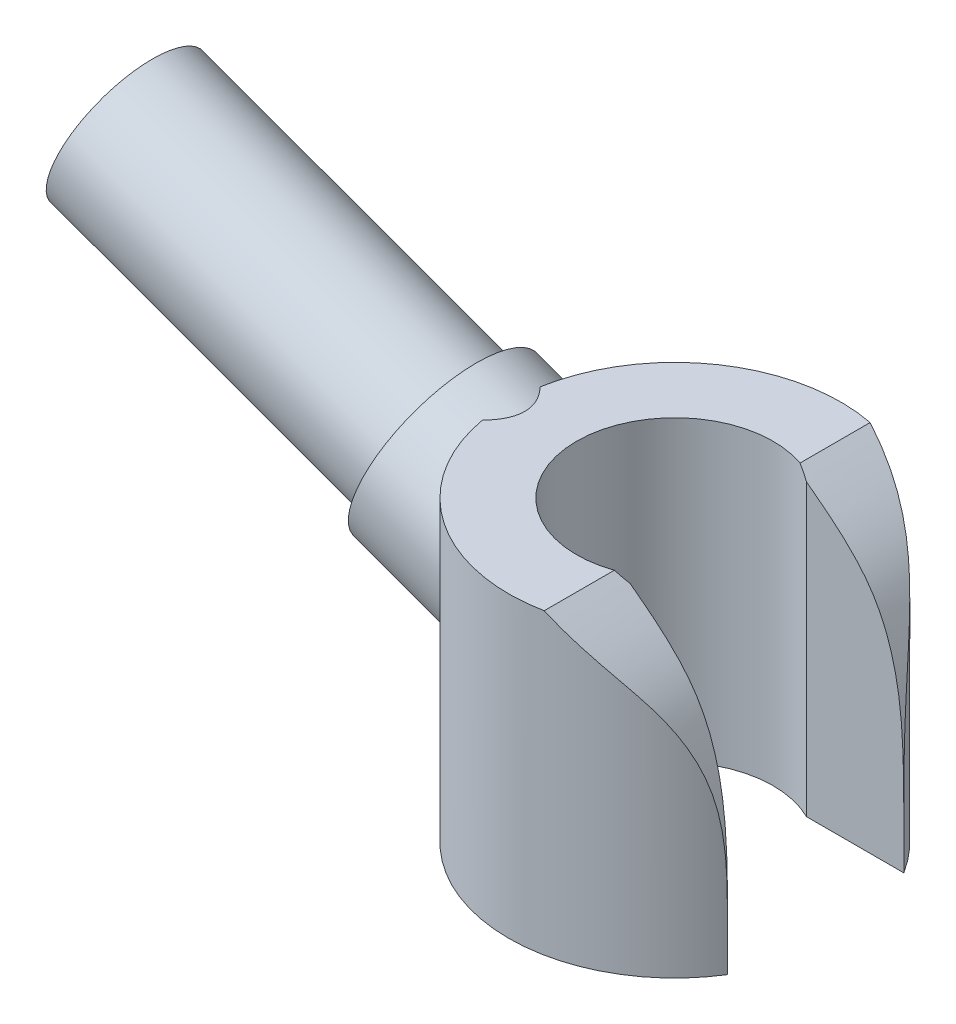
ISO-10303-21;
HEADER;
FILE_DESCRIPTION(('STEP AP214'),'2;1');
FILE_NAME('part.step','',(''),(''),'','','');
FILE_SCHEMA(('AUTOMOTIVE_DESIGN { 1 0 10303 214 1 1 1 1 }'));
ENDSEC;
DATA;
#1=APPLICATION_CONTEXT('core data for automotive mechanical design processes');
#2=APPLICATION_PROTOCOL_DEFINITION('international standard','automotive_design',2000,#1);
#3=PRODUCT_CONTEXT('',#1,'mechanical');
#4=PRODUCT('Part','Part','',(#3));
#5=PRODUCT_RELATED_PRODUCT_CATEGORY('part','',(#4));
#6=PRODUCT_DEFINITION_FORMATION('','',#4);
#7=PRODUCT_DEFINITION_CONTEXT('part definition',#1,'design');
#8=PRODUCT_DEFINITION('design','',#6,#7);
#9=PRODUCT_DEFINITION_SHAPE('','',#8);
#10=(LENGTH_UNIT() NAMED_UNIT(*) SI_UNIT(.MILLI.,.METRE.));
#11=(NAMED_UNIT(*) PLANE_ANGLE_UNIT() SI_UNIT($,.RADIAN.));
#12=(NAMED_UNIT(*) SI_UNIT($,.STERADIAN.) SOLID_ANGLE_UNIT());
#13=UNCERTAINTY_MEASURE_WITH_UNIT(LENGTH_MEASURE(1.E-05),#10,'distance_accuracy_value','');
#14=(GEOMETRIC_REPRESENTATION_CONTEXT(3) GLOBAL_UNCERTAINTY_ASSIGNED_CONTEXT((#13)) GLOBAL_UNIT_ASSIGNED_CONTEXT((#10,
#11,#12)) REPRESENTATION_CONTEXT('',''));
#15=CARTESIAN_POINT('',(0.,0.,0.));
#16=DIRECTION('',(0.,0.,1.));
#17=DIRECTION('',(1.,0.,0.));
#18=AXIS2_PLACEMENT_3D('',#15,#16,#17);
#19=CARTESIAN_POINT('',(-3.38969262078591,3.39202014332566,0.));
#20=DIRECTION('',(0.939692620785913,-0.342020143325657,0.));
#21=DIRECTION('',(0.342020143325657,0.939692620785913,0.));
#22=AXIS2_PLACEMENT_3D('',#19,#20,#21);
#23=PLANE('',#22);
#24=CARTESIAN_POINT('',(-3.38969262078591,3.39202014332566,0.));
#25=DIRECTION('',(0.939692620785913,-0.342020143325657,0.));
#26=DIRECTION('',(0.342020143325657,0.939692620785913,0.));
#27=AXIS2_PLACEMENT_3D('',#24,#25,#26);
#28=CIRCLE('',#27,1.35);
#29=CARTESIAN_POINT('',(-2.92796542729628,4.66060518138664,0.));
#30=VERTEX_POINT('',#29);
#31=EDGE_CURVE('E99',#30,#30,#28,.T.);
#32=ORIENTED_EDGE('',*,*,#31,.F.);
#33=EDGE_LOOP('',(#32));
#34=FACE_BOUND('',#33,.T.);
#35=CARTESIAN_POINT('',(-3.38969262078592,3.39202014332566,0.));
#36=DIRECTION('',(0.939692620785913,-0.342020143325657,0.));
#37=DIRECTION('',(0.342020143325657,0.939692620785913,0.));
#38=AXIS2_PLACEMENT_3D('',#35,#36,#37);
#39=CIRCLE('',#38,1.12);
#40=CARTESIAN_POINT('',(-3.00663006026118,4.44447587860588,0.));
#41=VERTEX_POINT('',#40);
#42=EDGE_CURVE('E11',#41,#41,#39,.F.);
#43=ORIENTED_EDGE('',*,*,#42,.F.);
#44=EDGE_LOOP('',(#43));
#45=FACE_BOUND('',#44,.T.);
#46=ADVANCED_FACE('F31',(#34,#45),#23,.F.);
#47=CARTESIAN_POINT('',(0.,4.4,0.));
#48=DIRECTION('',(0.,-1.,0.));
#49=DIRECTION('',(0.,0.,-1.));
#50=AXIS2_PLACEMENT_3D('',#47,#48,#49);
#51=CYLINDRICAL_SURFACE('',#50,2.45);
#52=CARTESIAN_POINT('',(0.,4.4,0.));
#53=DIRECTION('',(0.,1.,0.));
#54=DIRECTION('',(0.,0.,1.));
#55=AXIS2_PLACEMENT_3D('',#52,#53,#54);
#56=CIRCLE('',#55,2.45);
#57=CARTESIAN_POINT('',(-2.41282575040051,4.4,0.425172786293083));
#58=VERTEX_POINT('',#57);
#59=CARTESIAN_POINT('',(0.476655965729519,4.4,2.4031851968449));
#60=VERTEX_POINT('',#59);
#61=EDGE_CURVE('E96',#58,#60,#56,.T.);
#62=ORIENTED_EDGE('',*,*,#61,.F.);
#63=CARTESIAN_POINT('',(-2.41282575040051,4.4,0.425172786293081));
#64=CARTESIAN_POINT('',(-2.39988591058971,4.36931666462862,0.498618424196825));
#65=CARTESIAN_POINT('',(-2.38418497808994,4.33165567251845,0.568104445327409));
#66=CARTESIAN_POINT('',(-2.34936970274064,4.24545114185926,0.698173793075831));
#67=CARTESIAN_POINT('',(-2.33028634803408,4.19700545458846,0.75882952875616));
#68=CARTESIAN_POINT('',(-2.28612948077436,4.08004201982022,0.883999075099919));
#69=CARTESIAN_POINT('',(-2.26066388099269,4.00945431205265,0.946405969106936));
#70=CARTESIAN_POINT('',(-2.21023213902347,3.85841196111105,1.05885930115519));
#71=CARTESIAN_POINT('',(-2.18526900654357,3.77791126742107,1.10884452592137));
#72=CARTESIAN_POINT('',(-2.138600774343,3.60825552829581,1.19639957112753));
#73=CARTESIAN_POINT('',(-2.11693758719402,3.5190095846158,1.233815958412));
#74=CARTESIAN_POINT('',(-2.08060780242609,3.33454198678018,1.29415014145334));
#75=CARTESIAN_POINT('',(-2.06591879859152,3.23934059703153,1.31711444641755));
#76=CARTESIAN_POINT('',(-2.04962942450803,3.07238775159859,1.34226344597869));
#77=CARTESIAN_POINT('',(-2.04552318660296,3.00148949548302,1.34845409139535));
#78=CARTESIAN_POINT('',(-2.04382468127984,2.85942558252211,1.35103363726961));
#79=CARTESIAN_POINT('',(-2.04622570357059,2.78826027664969,1.34743263486856));
#80=CARTESIAN_POINT('',(-2.05791114257964,2.64742524963446,1.32951726101475));
#81=CARTESIAN_POINT('',(-2.06723343099445,2.57776593543142,1.31514394162494));
#82=CARTESIAN_POINT('',(-2.09198490658899,2.4427889575932,1.27539708611769));
#83=CARTESIAN_POINT('',(-2.10741533266924,2.37747217788597,1.25002131829758));
#84=CARTESIAN_POINT('',(-2.14109851324548,2.25818667462546,1.19131841053264));
#85=CARTESIAN_POINT('',(-2.1590268734982,2.20372815891181,1.15878945211295));
#86=CARTESIAN_POINT('',(-2.19666552665961,2.10116416618872,1.08574696210322));
#87=CARTESIAN_POINT('',(-2.21637627441592,2.05306031857836,1.04523138927833));
#88=CARTESIAN_POINT('',(-2.25717968917954,1.96068729798075,0.954095415711875));
#89=CARTESIAN_POINT('',(-2.27827279989645,1.9169200159042,0.902967147672534));
#90=CARTESIAN_POINT('',(-2.31853593569861,1.83778923823531,0.793897446158502));
#91=CARTESIAN_POINT('',(-2.33770531486261,1.80242855986465,0.735953738389505));
#92=CARTESIAN_POINT('',(-2.37385941456216,1.73807212269698,0.609847409700528));
#93=CARTESIAN_POINT('',(-2.39055960120973,1.7097822295735,0.541240826597591));
#94=CARTESIAN_POINT('',(-2.41829160806683,1.6637999166439,0.399477009497182));
#95=CARTESIAN_POINT('',(-2.42932349039733,1.64610738069723,0.326319825381214));
#96=CARTESIAN_POINT('',(-2.44469405178577,1.62164591289669,0.177617686593814));
#97=CARTESIAN_POINT('',(-2.4490423097322,1.61486134723069,0.10207630779535));
#98=CARTESIAN_POINT('',(-2.4506730629951,1.61230480441462,-0.0492628013254218));
#99=CARTESIAN_POINT('',(-2.44795631220014,1.61653165226557,-0.125060503434175));
#100=CARTESIAN_POINT('',(-2.43583087093539,1.63571906199429,-0.273216736074215));
#101=CARTESIAN_POINT('',(-2.42655327922109,1.65046939394841,-0.345613477724229));
#102=CARTESIAN_POINT('',(-2.40227025242306,1.69021252656254,-0.486530320479415));
#103=CARTESIAN_POINT('',(-2.38726413171334,1.71520655327803,-0.555049956420874));
#104=CARTESIAN_POINT('',(-2.35259878975083,1.77552065605211,-0.687407498496295));
#105=CARTESIAN_POINT('',(-2.33287379678801,1.81098852200446,-0.751160798989491));
#106=CARTESIAN_POINT('',(-2.29075258856597,1.89168813712505,-0.871207547695333));
#107=CARTESIAN_POINT('',(-2.26835543432077,1.93692332303588,-0.927498358865413));
#108=CARTESIAN_POINT('',(-2.22292232291698,2.03724000149835,-1.0316914270965));
#109=CARTESIAN_POINT('',(-2.19988191964633,2.09243363220076,-1.07948436349298));
#110=CARTESIAN_POINT('',(-2.15620723345248,2.21137803473955,-1.1642819527913));
#111=CARTESIAN_POINT('',(-2.13557063656963,2.27512044797391,-1.20129703306693));
#112=CARTESIAN_POINT('',(-2.10074253405258,2.40482854969099,-1.26115205103595));
#113=CARTESIAN_POINT('',(-2.08620019520938,2.47032376887494,-1.28480488903098));
#114=CARTESIAN_POINT('',(-2.06330123879884,2.60526323617005,-1.32127220892876));
#115=CARTESIAN_POINT('',(-2.0549415879834,2.67470552980134,-1.33409200599948));
#116=CARTESIAN_POINT('',(-2.04539936623501,2.81002975162177,-1.34866873134773));
#117=CARTESIAN_POINT('',(-2.04373901619049,2.87580328886916,-1.35116246482938));
#118=CARTESIAN_POINT('',(-2.0459238966236,3.00704331002154,-1.34784795639077));
#119=CARTESIAN_POINT('',(-2.04977347746682,3.07250951031103,-1.34203315447312));
#120=CARTESIAN_POINT('',(-2.0645556958928,3.22712905529824,-1.3192295184921));
#121=CARTESIAN_POINT('',(-2.07766563385608,3.31556009460895,-1.29876654449614));
#122=CARTESIAN_POINT('',(-2.11011344297298,3.48739283810433,-1.2453455534766));
#123=CARTESIAN_POINT('',(-2.12946328983412,3.57078450225028,-1.21236348793717));
#124=CARTESIAN_POINT('',(-2.1720790372472,3.73248748341156,-1.1342797270285));
#125=CARTESIAN_POINT('',(-2.19540749880843,3.81068446439786,-1.08897618798886));
#126=CARTESIAN_POINT('',(-2.24318848715001,3.95878347337886,-0.986804550677004));
#127=CARTESIAN_POINT('',(-2.26764058934425,4.02868859940503,-0.929940793261109));
#128=CARTESIAN_POINT('',(-2.31094350414628,4.14650627088995,-0.81553972022275));
#129=CARTESIAN_POINT('',(-2.3300267595758,4.19612755630985,-0.759854319837121));
#130=CARTESIAN_POINT('',(-2.36554076209757,4.28593096480822,-0.640733386674065));
#131=CARTESIAN_POINT('',(-2.38198173731986,4.32614977364748,-0.577329494468309));
#132=CARTESIAN_POINT('',(-2.40216389305746,4.37466946879719,-0.482628414114282));
#133=CARTESIAN_POINT('',(-2.40771816963635,4.38790214337011,-0.454181248698265));
#134=CARTESIAN_POINT('',(-2.41282575040052,4.40000000000002,-0.425172786293095));
#135=B_SPLINE_CURVE_WITH_KNOTS('',3,(#63,#64,#65,#66,#67,#68,#69,#70,#71,#72,#73,#74,#75,#76,
#77,#78,#79,#80,#81,#82,#83,#84,#85,#86,#87,#88,#89,#90,#91,#92,#93,#94,#95,#96,#97,#98,#99,
#100,#101,#102,#103,#104,#105,#106,#107,#108,#109,#110,#111,#112,#113,#114,#115,#116,#117,#118,
#119,#120,#121,#122,#123,#124,#125,#126,#127,#128,#129,#130,#131,#132,#133,#134),.UNSPECIFIED.,
.F.,.F.,(4,2,2,2,2,2,2,2,2,2,2,2,2,2,2,2,2,2,2,2,2,2,2,2,2,2,2,2,2,2,2,2,2,2,2,4),(0.,
0.240745959479237,0.479390699188284,0.770745393089824,1.06350859748807,1.35972579270513,
1.65498477028629,1.86801439999348,2.08082443700628,2.29480758767701,2.50883416234977,
2.70574454778162,2.90270532536687,3.11341147744042,3.32418814215309,3.55130354498492,
3.7784164587253,4.00520357252416,4.23196648745788,4.45432177345678,4.67670368066733,
4.90238702655036,5.12814991146523,5.35663474540472,5.58489778440962,5.79713123825066,
6.00926050043127,6.20596125466506,6.4028173996647,6.67646816421332,6.95064727982838,
7.22962080211964,7.50848976283755,7.73865718508112,7.9679109861141,8.06341151356881),.UNSPECIFIED.);
#136=CARTESIAN_POINT('',(-2.41282575040051,4.4,-0.425172786293083));
#137=VERTEX_POINT('',#136);
#138=EDGE_CURVE('E92',#58,#137,#135,.T.);
#139=ORIENTED_EDGE('',*,*,#138,.T.);
#140=CARTESIAN_POINT('',(0.476655965729519,4.4,-2.4031851968449));
#141=VERTEX_POINT('',#140);
#142=EDGE_CURVE('E94',#141,#137,#56,.T.);
#143=ORIENTED_EDGE('',*,*,#142,.F.);
#144=CARTESIAN_POINT('',(0.47665596572952,4.4,-2.4031851968449));
#145=CARTESIAN_POINT('',(0.53150353945028,4.3595446771422,-2.39232522079032));
#146=CARTESIAN_POINT('',(0.586095385820755,4.3192663629422,-2.37952807735011));
#147=CARTESIAN_POINT('',(0.694254976975693,4.23861947370203,-2.35023966806376));
#148=CARTESIAN_POINT('',(0.747822206110757,4.1982508640704,-2.33374659266907));
#149=CARTESIAN_POINT('',(0.853376853149585,4.11700887504917,-2.29725346948604));
#150=CARTESIAN_POINT('',(0.905363914473166,4.07613538461223,-2.27725263693141));
#151=CARTESIAN_POINT('',(1.00765188089936,3.99312981911943,-2.2338858811418));
#152=CARTESIAN_POINT('',(1.05793569706213,3.9509902264753,-2.21049398863174));
#153=CARTESIAN_POINT('',(1.15584310009094,3.86533390120601,-2.16091121304236));
#154=CARTESIAN_POINT('',(1.20346773972593,3.82181772441446,-2.13472144977744));
#155=CARTESIAN_POINT('',(1.29557074091572,3.73290418563762,-2.08011029940707));
#156=CARTESIAN_POINT('',(1.34004982536836,3.68750725970598,-2.05168942823394));
#157=CARTESIAN_POINT('',(1.4060444658371,3.61536984242393,-2.00657467526936));
#158=CARTESIAN_POINT('',(1.42884602046909,3.58947954097563,-1.99039176140458));
#159=CARTESIAN_POINT('',(1.47325824708642,3.53686461206565,-1.9577458782058));
#160=CARTESIAN_POINT('',(1.49486892980813,3.51013999212922,-1.94128291139838));
#161=CARTESIAN_POINT('',(1.53679025175109,3.45575958967027,-1.90826805036856));
#162=CARTESIAN_POINT('',(1.55710139815526,3.42810417692803,-1.89171619360584));
#163=CARTESIAN_POINT('',(1.59631773095982,3.37174176526448,-1.85874348537887));
#164=CARTESIAN_POINT('',(1.61522294791736,3.3430347892186,-1.84232263107429));
#165=CARTESIAN_POINT('',(1.66952178147438,3.25592167818041,-1.79375021539527));
#166=CARTESIAN_POINT('',(1.70288659084155,3.19602043216211,-1.76197784955073));
#167=CARTESIAN_POINT('',(1.76435930778591,3.07259183648347,-1.70042101262316));
#168=CARTESIAN_POINT('',(1.7924651542271,3.00906307777697,-1.67063732388785));
#169=CARTESIAN_POINT('',(1.8436607579741,2.87894859993681,-1.61396133549525));
#170=CARTESIAN_POINT('',(1.86676040349662,2.81236922754711,-1.58706339002503));
#171=CARTESIAN_POINT('',(1.90838745364143,2.67653262736807,-1.53675777266729));
#172=CARTESIAN_POINT('',(1.9269153139977,2.60727566728822,-1.51334975298204));
#173=CARTESIAN_POINT('',(1.96002798637204,2.46584000130459,-1.47021722148731));
#174=CARTESIAN_POINT('',(1.97456742101334,2.39363761300423,-1.45053583095097));
#175=CARTESIAN_POINT('',(1.99995241640282,2.24758481371603,-1.41533089218447));
#176=CARTESIAN_POINT('',(2.01079715707408,2.17373404072238,-1.39980826719997));
#177=CARTESIAN_POINT('',(2.0296962995662,2.0221083709425,-1.37226911805772));
#178=CARTESIAN_POINT('',(2.03762950917109,1.94429076549506,-1.36040759163542));
#179=CARTESIAN_POINT('',(2.05075397734832,1.78788094480502,-1.34054047617613));
#180=CARTESIAN_POINT('',(2.05594269713468,1.70928808061648,-1.33253845797198));
#181=CARTESIAN_POINT('',(2.06419736242051,1.55161938790305,-1.31971452512595));
#182=CARTESIAN_POINT('',(2.06725984644622,1.47254298228006,-1.31489779668152));
#183=CARTESIAN_POINT('',(2.07178344829813,1.31622574657956,-1.30775747626913));
#184=CARTESIAN_POINT('',(2.07328267427887,1.23898843239719,-1.30537458492591));
#185=CARTESIAN_POINT('',(2.07532655547426,1.08461048871232,-1.30212257890149));
#186=CARTESIAN_POINT('',(2.07587284803438,1.00746992139662,-1.30125086770231));
#187=CARTESIAN_POINT('',(2.0764950337704,0.853549719422316,-1.30025657781194));
#188=CARTESIAN_POINT('',(2.07657316650295,0.776770124905537,-1.30013043256376));
#189=CARTESIAN_POINT('',(2.07665596572953,0.7,-1.30000000000003));
#190=B_SPLINE_CURVE_WITH_KNOTS('',3,(#144,#145,#146,#147,#148,#149,#150,#151,#152,#153,#154,
#155,#156,#157,#158,#159,#160,#161,#162,#163,#164,#165,#166,#167,#168,#169,#170,#171,#172,#173,
#174,#175,#176,#177,#178,#179,#180,#181,#182,#183,#184,#185,#186,#187,#188,#189),.UNSPECIFIED.,
.F.,.F.,(4,2,2,2,2,2,2,2,2,2,2,2,2,2,2,2,2,2,2,2,2,2,4),(0.,0.207010470253677,0.414122516275214,
0.621280957290529,0.830119036755556,1.03887384221755,1.24758051559542,1.361876068051,
1.47617058990106,1.59042022931811,1.7046673848517,1.9310479974542,2.15751715001048,
2.38353482075564,2.60952995203758,2.83799866261543,3.06651805128296,3.30368952297328,
3.54108000774991,3.77885605946548,4.01068967149564,4.24212454947406,4.47245141271071),.UNSPECIFIED.);
#191=CARTESIAN_POINT('',(2.07665596572952,0.7,-1.3));
#192=VERTEX_POINT('',#191);
#193=EDGE_CURVE('E180',#141,#192,#190,.T.);
#194=ORIENTED_EDGE('',*,*,#193,.T.);
#195=DIRECTION('',(0.,-1.,0.));
#196=VECTOR('',#195,1.);
#197=CARTESIAN_POINT('',(2.07665596572952,4.4,-1.3));
#198=LINE('',#197,#196);
#199=CARTESIAN_POINT('',(2.07665596572952,0.,-1.3));
#200=VERTEX_POINT('',#199);
#201=EDGE_CURVE('E117',#192,#200,#198,.T.);
#202=ORIENTED_EDGE('',*,*,#201,.T.);
#203=CARTESIAN_POINT('',(0.,0.,0.));
#204=DIRECTION('',(0.,1.,0.));
#205=DIRECTION('',(0.,0.,1.));
#206=AXIS2_PLACEMENT_3D('',#203,#204,#205);
#207=CIRCLE('',#206,2.45);
#208=CARTESIAN_POINT('',(2.07665596572952,0.,1.3));
#209=VERTEX_POINT('',#208);
#210=EDGE_CURVE('E128',#200,#209,#207,.T.);
#211=ORIENTED_EDGE('',*,*,#210,.T.);
#212=DIRECTION('',(0.,-1.,0.));
#213=VECTOR('',#212,1.);
#214=CARTESIAN_POINT('',(2.07665596572952,4.4,1.3));
#215=LINE('',#214,#213);
#216=CARTESIAN_POINT('',(2.07665596572952,0.7,1.3));
#217=VERTEX_POINT('',#216);
#218=EDGE_CURVE('E111',#217,#209,#215,.T.);
#219=ORIENTED_EDGE('',*,*,#218,.F.);
#220=CARTESIAN_POINT('',(2.07665596572952,0.700000000015263,1.3));
#221=CARTESIAN_POINT('',(2.0765844240633,0.767203291394049,1.30011343720235));
#222=CARTESIAN_POINT('',(2.0765152914592,0.834411400407841,1.30022448712683));
#223=CARTESIAN_POINT('',(2.07606549244616,0.969004533799708,1.30094310396703));
#224=CARTESIAN_POINT('',(2.07568398539927,1.03638954590176,1.30155201067013));
#225=CARTESIAN_POINT('',(2.07428938770056,1.17120499597185,1.30377349734349));
#226=CARTESIAN_POINT('',(2.07327569481275,1.23863541594108,1.3053870343472));
#227=CARTESIAN_POINT('',(2.07024209170521,1.37514700888221,1.31019328031497));
#228=CARTESIAN_POINT('',(2.06819715953486,1.44422638711779,1.31342524434412));
#229=CARTESIAN_POINT('',(2.06270895238542,1.58214461453984,1.3220281688877));
#230=CARTESIAN_POINT('',(2.059266895326,1.6509836206844,1.32739726631403));
#231=CARTESIAN_POINT('',(2.0505826674235,1.78827291838715,1.34077374987009));
#232=CARTESIAN_POINT('',(2.04534116030213,1.85672334382243,1.34878016318975));
#233=CARTESIAN_POINT('',(2.03142427357194,2.00602261793828,1.36967334751708));
#234=CARTESIAN_POINT('',(2.02228425453612,2.08674256758847,1.38320016604792));
#235=CARTESIAN_POINT('',(2.00013762783096,2.24671860886637,1.41503538519374));
#236=CARTESIAN_POINT('',(1.98713089025081,2.3259746512159,1.43334394645924));
#237=CARTESIAN_POINT('',(1.95674497666294,2.48139940824921,1.4745493220704));
#238=CARTESIAN_POINT('',(1.93941955357964,2.55759360759569,1.49738907333991));
#239=CARTESIAN_POINT('',(1.89971059261431,2.70720924052297,1.54745570431494));
#240=CARTESIAN_POINT('',(1.87732607237625,2.78063013235769,1.57468343576654));
#241=CARTESIAN_POINT('',(1.83524194182155,2.90051712389535,1.62328459624708));
#242=CARTESIAN_POINT('',(1.81706531819743,2.94793357096051,1.64365354954353));
#243=CARTESIAN_POINT('',(1.77806453068724,3.04103572406753,1.68576702611298));
#244=CARTESIAN_POINT('',(1.75724058539119,3.08672157260156,1.70751143573981));
#245=CARTESIAN_POINT('',(1.71284567912454,3.17617732222398,1.75204074885404));
#246=CARTESIAN_POINT('',(1.68927612933337,3.21994819179379,1.77482511419691));
#247=CARTESIAN_POINT('',(1.639041981111,3.3059053824304,1.82132542609816));
#248=CARTESIAN_POINT('',(1.61234786194311,3.34807060328956,1.84504857588745));
#249=CARTESIAN_POINT('',(1.55598785873806,3.43018759599508,1.89281829683381));
#250=CARTESIAN_POINT('',(1.52632119522759,3.47013878298016,1.91686495138305));
#251=CARTESIAN_POINT('',(1.46433387132902,3.54814063510913,1.96462732280043));
#252=CARTESIAN_POINT('',(1.43201249452926,3.58619078274589,1.98834294830227));
#253=CARTESIAN_POINT('',(1.35544821788533,3.67135204810049,2.04156980993181));
#254=CARTESIAN_POINT('',(1.31043688865546,3.7179473516117,2.07080186545287));
#255=CARTESIAN_POINT('',(1.21707988115234,3.80912315334896,2.12701411192038));
#256=CARTESIAN_POINT('',(1.16873341792726,3.8537031731462,2.15399376942093));
#257=CARTESIAN_POINT('',(1.06922645727572,3.94138944549496,2.20508131564031));
#258=CARTESIAN_POINT('',(1.01806474800387,3.98449505021961,2.22918795328389));
#259=CARTESIAN_POINT('',(0.913914811445533,4.06934929056126,2.27386158664126));
#260=CARTESIAN_POINT('',(0.860945065574205,4.11110617044396,2.29445606176213));
#261=CARTESIAN_POINT('',(0.753337644706738,4.19407449178629,2.33199952918819));
#262=CARTESIAN_POINT('',(0.69870039562682,4.23528606873597,2.34894944363972));
#263=CARTESIAN_POINT('',(0.588349294710356,4.31760362193888,2.37899969593867));
#264=CARTESIAN_POINT('',(0.53263605963389,4.35870964423326,2.39210217321706));
#265=CARTESIAN_POINT('',(0.476655965729532,4.4,2.40318519684503));
#266=B_SPLINE_CURVE_WITH_KNOTS('',3,(#220,#221,#222,#223,#224,#225,#226,#227,#228,#229,#230,
#231,#232,#233,#234,#235,#236,#237,#238,#239,#240,#241,#242,#243,#244,#245,#246,#247,#248,#249,
#250,#251,#252,#253,#254,#255,#256,#257,#258,#259,#260,#261,#262,#263,#264,#265),.UNSPECIFIED.,
.F.,.F.,(4,2,2,2,2,2,2,2,2,2,2,2,2,2,2,2,2,2,2,2,2,2,4),(0.,0.20161841381904,0.403781197782409,
0.606136861846602,0.813657378648736,1.02099738019005,1.22826098701744,1.47510980060625,
1.72196690855468,1.96589279585407,2.20986608849987,2.37390931042692,2.53793899605005,
2.70188474300027,2.86752807125812,3.03321494946156,3.19894668843893,3.41201111353163,
3.62512585735272,3.83833306690174,4.04978687227006,4.26118711249815,4.47246957655181),.UNSPECIFIED.);
#267=EDGE_CURVE('E131',#217,#60,#266,.T.);
#268=ORIENTED_EDGE('',*,*,#267,.T.);
#269=EDGE_LOOP('',(#62,#139,#143,#194,#202,#211,#219,#268));
#270=FACE_BOUND('',#269,.T.);
#271=ADVANCED_FACE('F33',(#270),#51,.T.);
#272=CARTESIAN_POINT('',(2.07665596572952,4.4,1.3));
#273=DIRECTION('',(0.,0.,1.));
#274=DIRECTION('',(1.,0.,0.));
#275=AXIS2_PLACEMENT_3D('',#272,#273,#274);
#276=PLANE('',#275);
#277=DIRECTION('',(0.,-1.,0.));
#278=VECTOR('',#277,1.);
#279=CARTESIAN_POINT('',(0.642261628933258,4.4,1.3));
#280=LINE('',#279,#278);
#281=CARTESIAN_POINT('',(0.642261628933188,4.27738704251207,1.3));
#282=VERTEX_POINT('',#281);
#283=CARTESIAN_POINT('',(0.642261628933258,0.,1.3));
#284=VERTEX_POINT('',#283);
#285=EDGE_CURVE('E113',#282,#284,#280,.T.);
#286=ORIENTED_EDGE('',*,*,#285,.F.);
#287=CARTESIAN_POINT('',(0.476655965729519,4.4,1.3));
#288=CARTESIAN_POINT('',(0.891869453989146,4.09369735227973,1.3));
#289=CARTESIAN_POINT('',(2.07402223612289,3.22162422022621,1.3));
#290=CARTESIAN_POINT('',(2.07561963155648,1.69222233915047,1.3));
#291=CARTESIAN_POINT('',(2.07665596572952,0.7,1.3));
#292=B_SPLINE_CURVE_WITH_KNOTS('',3,(#287,#288,#289,#290,#291),.UNSPECIFIED.,.F.,.F.,(4,1,4),
(0.,0.35123504722476,1.),.UNSPECIFIED.);
#293=EDGE_CURVE('E138',#282,#217,#292,.T.);
#294=ORIENTED_EDGE('',*,*,#293,.T.);
#295=ORIENTED_EDGE('',*,*,#218,.T.);
#296=DIRECTION('',(-1.,0.,0.));
#297=VECTOR('',#296,1.);
#298=CARTESIAN_POINT('',(2.07665596572952,0.,1.3));
#299=LINE('',#298,#297);
#300=EDGE_CURVE('E125',#209,#284,#299,.T.);
#301=ORIENTED_EDGE('',*,*,#300,.T.);
#302=EDGE_LOOP('',(#286,#294,#295,#301));
#303=FACE_BOUND('',#302,.T.);
#304=ADVANCED_FACE('F189',(#303),#276,.F.);
#305=CARTESIAN_POINT('',(0.,4.4,0.));
#306=DIRECTION('',(0.,-1.,0.));
#307=DIRECTION('',(0.,0.,-1.));
#308=AXIS2_PLACEMENT_3D('',#305,#306,#307);
#309=CYLINDRICAL_SURFACE('',#308,1.45);
#310=CARTESIAN_POINT('',(0.,4.4,0.));
#311=DIRECTION('',(0.,-1.,0.));
#312=DIRECTION('',(0.,0.,1.));
#313=AXIS2_PLACEMENT_3D('',#310,#311,#312);
#314=CIRCLE('',#313,1.45);
#315=CARTESIAN_POINT('',(0.476655965729519,4.4,1.36941560175663));
#316=VERTEX_POINT('',#315);
#317=CARTESIAN_POINT('',(0.476655965729519,4.4,-1.36941560175663));
#318=VERTEX_POINT('',#317);
#319=EDGE_CURVE('E105',#316,#318,#314,.T.);
#320=ORIENTED_EDGE('',*,*,#319,.F.);
#321=CARTESIAN_POINT('',(0.476655965729519,4.4,1.36941560175663));
#322=CARTESIAN_POINT('',(0.504794029428128,4.37927880574023,1.35963239973984));
#323=CARTESIAN_POINT('',(0.532663533211078,4.35870046215302,1.34895616525176));
#324=CARTESIAN_POINT('',(0.587865420945661,4.31782947632368,1.32581763133299));
#325=CARTESIAN_POINT('',(0.615197804897294,4.29753683408157,1.31335533190232));
#326=CARTESIAN_POINT('',(0.642261628933268,4.277387042512,1.30000000000034));
#327=B_SPLINE_CURVE_WITH_KNOTS('',3,(#321,#322,#323,#324,#325,#326),.UNSPECIFIED.,.F.,.F.,(4,2,
4),(0.,0.108754011598256,0.217508023196511),.UNSPECIFIED.);
#328=EDGE_CURVE('E54',#316,#282,#327,.T.);
#329=ORIENTED_EDGE('',*,*,#328,.T.);
#330=ORIENTED_EDGE('',*,*,#285,.T.);
#331=CARTESIAN_POINT('',(0.,0.,0.));
#332=DIRECTION('',(0.,-1.,0.));
#333=DIRECTION('',(0.,0.,1.));
#334=AXIS2_PLACEMENT_3D('',#331,#332,#333);
#335=CIRCLE('',#334,1.45);
#336=CARTESIAN_POINT('',(0.642261628933258,0.,-1.3));
#337=VERTEX_POINT('',#336);
#338=EDGE_CURVE('E122',#284,#337,#335,.T.);
#339=ORIENTED_EDGE('',*,*,#338,.T.);
#340=DIRECTION('',(0.,-1.,0.));
#341=VECTOR('',#340,1.);
#342=CARTESIAN_POINT('',(0.642261628933258,4.4,-1.3));
#343=LINE('',#342,#341);
#344=CARTESIAN_POINT('',(0.642261638694219,4.27738703523215,-1.3));
#345=VERTEX_POINT('',#344);
#346=EDGE_CURVE('E115',#345,#337,#343,.T.);
#347=ORIENTED_EDGE('',*,*,#346,.F.);
#348=CARTESIAN_POINT('',(0.642261628933188,4.27738704251207,-1.3));
#349=CARTESIAN_POINT('',(0.615197804897258,4.2975368340816,-1.31335533190215));
#350=CARTESIAN_POINT('',(0.587865420945654,4.31782947632369,-1.32581763133294));
#351=CARTESIAN_POINT('',(0.532663533211097,4.358700462153,-1.34895616525181));
#352=CARTESIAN_POINT('',(0.504794029428145,4.37927880574022,-1.35963239973989));
#353=CARTESIAN_POINT('',(0.476655965729519,4.4,-1.36941560175662));
#354=B_SPLINE_CURVE_WITH_KNOTS('',3,(#348,#349,#350,#351,#352,#353),.UNSPECIFIED.,.F.,.F.,(4,2,
4),(0.,0.108754011598262,0.217508023196525),.UNSPECIFIED.);
#355=EDGE_CURVE('E170',#345,#318,#354,.T.);
#356=ORIENTED_EDGE('',*,*,#355,.T.);
#357=EDGE_LOOP('',(#320,#329,#330,#339,#347,#356));
#358=FACE_BOUND('',#357,.T.);
#359=ADVANCED_FACE('F184',(#358),#309,.F.);
#360=CARTESIAN_POINT('',(2.07665596572952,4.4,-1.3));
#361=DIRECTION('',(0.,0.,-1.));
#362=DIRECTION('',(-1.,0.,0.));
#363=AXIS2_PLACEMENT_3D('',#360,#361,#362);
#364=PLANE('',#363);
#365=ORIENTED_EDGE('',*,*,#201,.F.);
#366=CARTESIAN_POINT('',(0.476655965729519,4.4,-1.3));
#367=CARTESIAN_POINT('',(0.891869453989146,4.09369735227973,-1.3));
#368=CARTESIAN_POINT('',(2.07402223612289,3.22162422022621,-1.3));
#369=CARTESIAN_POINT('',(2.07561963155648,1.69222233915047,-1.3));
#370=CARTESIAN_POINT('',(2.07665596572952,0.7,-1.3));
#371=B_SPLINE_CURVE_WITH_KNOTS('',3,(#366,#367,#368,#369,#370),.UNSPECIFIED.,.F.,.F.,(4,1,4),
(0.,0.35123504722476,1.),.UNSPECIFIED.);
#372=EDGE_CURVE('E98',#192,#345,#371,.F.);
#373=ORIENTED_EDGE('',*,*,#372,.T.);
#374=ORIENTED_EDGE('',*,*,#346,.T.);
#375=DIRECTION('',(1.,0.,0.));
#376=VECTOR('',#375,1.);
#377=CARTESIAN_POINT('',(2.07665596572952,0.,-1.3));
#378=LINE('',#377,#376);
#379=EDGE_CURVE('E119',#337,#200,#378,.T.);
#380=ORIENTED_EDGE('',*,*,#379,.T.);
#381=EDGE_LOOP('',(#365,#373,#374,#380));
#382=FACE_BOUND('',#381,.T.);
#383=ADVANCED_FACE('F188',(#382),#364,.F.);
#384=CARTESIAN_POINT('',(0.,4.4,0.));
#385=DIRECTION('',(0.,1.,0.));
#386=DIRECTION('',(0.,0.,1.));
#387=AXIS2_PLACEMENT_3D('',#384,#385,#386);
#388=PLANE('',#387);
#389=CARTESIAN_POINT('',(-6.15909451626388,4.4,0.));
#390=DIRECTION('',(0.,1.,0.));
#391=DIRECTION('',(1.,0.,0.));
#392=AXIS2_PLACEMENT_3D('',#389,#390,#391);
#393=ELLIPSE('',#392,3.94713594022031,1.35);
#394=EDGE_CURVE('E40',#58,#137,#393,.T.);
#395=ORIENTED_EDGE('',*,*,#394,.F.);
#396=ORIENTED_EDGE('',*,*,#61,.T.);
#397=DIRECTION('',(0.,0.,1.));
#398=VECTOR('',#397,1.);
#399=CARTESIAN_POINT('',(0.476655965729519,4.4,-2.45));
#400=LINE('',#399,#398);
#401=EDGE_CURVE('E108',#316,#60,#400,.T.);
#402=ORIENTED_EDGE('',*,*,#401,.F.);
#403=ORIENTED_EDGE('',*,*,#319,.T.);
#404=EDGE_CURVE('E104',#141,#318,#400,.T.);
#405=ORIENTED_EDGE('',*,*,#404,.F.);
#406=ORIENTED_EDGE('',*,*,#142,.T.);
#407=EDGE_LOOP('',(#395,#396,#402,#403,#405,#406));
#408=FACE_BOUND('',#407,.T.);
#409=ADVANCED_FACE('F102',(#408),#388,.T.);
#410=CARTESIAN_POINT('',(0.,0.,0.));
#411=DIRECTION('',(0.,1.,0.));
#412=DIRECTION('',(0.,0.,1.));
#413=AXIS2_PLACEMENT_3D('',#410,#411,#412);
#414=PLANE('',#413);
#415=ORIENTED_EDGE('',*,*,#210,.F.);
#416=ORIENTED_EDGE('',*,*,#379,.F.);
#417=ORIENTED_EDGE('',*,*,#338,.F.);
#418=ORIENTED_EDGE('',*,*,#300,.F.);
#419=EDGE_LOOP('',(#415,#416,#417,#418));
#420=FACE_BOUND('',#419,.T.);
#421=ADVANCED_FACE('F149',(#420),#414,.F.);
#422=CARTESIAN_POINT('',(0.476655965729519,4.4,-2.45));
#423=CARTESIAN_POINT('',(0.891869453989146,4.09369735227973,-2.45));
#424=CARTESIAN_POINT('',(2.07402223612289,3.22162422022621,-2.45));
#425=CARTESIAN_POINT('',(2.07561963155648,1.69222233915047,-2.45));
#426=CARTESIAN_POINT('',(2.07665596572952,0.7,-2.45));
#427=B_SPLINE_CURVE_WITH_KNOTS('',3,(#422,#423,#424,#425,#426),.UNSPECIFIED.,.F.,.F.,(4,1,4),
(0.,0.35123504722476,1.),.UNSPECIFIED.);
#428=DIRECTION('',(0.,0.,1.));
#429=VECTOR('',#428,1.);
#430=SURFACE_OF_LINEAR_EXTRUSION('',#427,#429);
#431=ORIENTED_EDGE('',*,*,#293,.F.);
#432=ORIENTED_EDGE('',*,*,#328,.F.);
#433=ORIENTED_EDGE('',*,*,#401,.T.);
#434=ORIENTED_EDGE('',*,*,#267,.F.);
#435=EDGE_LOOP('',(#431,#432,#433,#434));
#436=FACE_BOUND('',#435,.T.);
#437=ADVANCED_FACE('F142',(#436),#430,.F.);
#438=ORIENTED_EDGE('',*,*,#404,.T.);
#439=ORIENTED_EDGE('',*,*,#355,.F.);
#440=ORIENTED_EDGE('',*,*,#372,.F.);
#441=ORIENTED_EDGE('',*,*,#193,.F.);
#442=EDGE_LOOP('',(#438,#439,#440,#441));
#443=FACE_BOUND('',#442,.T.);
#444=ADVANCED_FACE('F148',(#443),#430,.F.);
#445=CARTESIAN_POINT('',(-3.38969262078591,3.39202014332566,0.));
#446=DIRECTION('',(0.939692620785913,-0.342020143325657,0.));
#447=DIRECTION('',(0.342020143325657,0.939692620785913,0.));
#448=AXIS2_PLACEMENT_3D('',#445,#446,#447);
#449=CYLINDRICAL_SURFACE('',#448,1.35);
#450=ORIENTED_EDGE('',*,*,#31,.T.);
#451=EDGE_LOOP('',(#450));
#452=FACE_BOUND('',#451,.T.);
#453=ORIENTED_EDGE('',*,*,#138,.F.);
#454=ORIENTED_EDGE('',*,*,#394,.T.);
#455=EDGE_LOOP('',(#453,#454));
#456=FACE_BOUND('',#455,.T.);
#457=ADVANCED_FACE('F107',(#452,#456),#449,.T.);
#458=CARTESIAN_POINT('',(-8.08815572471548,5.10212085995394,0.));
#459=DIRECTION('',(0.939692620785913,-0.342020143325657,0.));
#460=DIRECTION('',(0.342020143325657,0.939692620785913,0.));
#461=AXIS2_PLACEMENT_3D('',#458,#459,#460);
#462=CYLINDRICAL_SURFACE('',#461,1.12);
#463=CARTESIAN_POINT('',(-8.08815572471548,5.10212085995394,0.));
#464=DIRECTION('',(-0.939692620785913,0.342020143325657,0.));
#465=DIRECTION('',(-0.342020143325657,-0.939692620785913,0.));
#466=AXIS2_PLACEMENT_3D('',#463,#464,#465);
#467=CIRCLE('',#466,1.12);
#468=CARTESIAN_POINT('',(-8.47121828524021,4.04966512467372,0.));
#469=VERTEX_POINT('',#468);
#470=EDGE_CURVE('E233',#469,#469,#467,.T.);
#471=ORIENTED_EDGE('',*,*,#470,.F.);
#472=EDGE_LOOP('',(#471));
#473=FACE_BOUND('',#472,.T.);
#474=ORIENTED_EDGE('',*,*,#42,.T.);
#475=EDGE_LOOP('',(#474));
#476=FACE_BOUND('',#475,.T.);
#477=ADVANCED_FACE('F213',(#473,#476),#462,.T.);
#478=CARTESIAN_POINT('',(-8.08815572471548,5.10212085995394,0.));
#479=DIRECTION('',(-0.939692620785913,0.342020143325657,0.));
#480=DIRECTION('',(-0.342020143325657,-0.939692620785913,0.));
#481=AXIS2_PLACEMENT_3D('',#478,#479,#480);
#482=PLANE('',#481);
#483=ORIENTED_EDGE('',*,*,#470,.T.);
#484=EDGE_LOOP('',(#483));
#485=FACE_BOUND('',#484,.T.);
#486=ADVANCED_FACE('F225',(#485),#482,.T.);
#487=CLOSED_SHELL('',(#46,#271,#304,#359,#383,#409,#421,#437,#444,#457,#477,#486));
#488=MANIFOLD_SOLID_BREP('B2',#487);
#489=ADVANCED_BREP_SHAPE_REPRESENTATION('',(#18,#488),#14);
#490=SHAPE_DEFINITION_REPRESENTATION(#9,#489);
ENDSEC;
END-ISO-10303-21;
